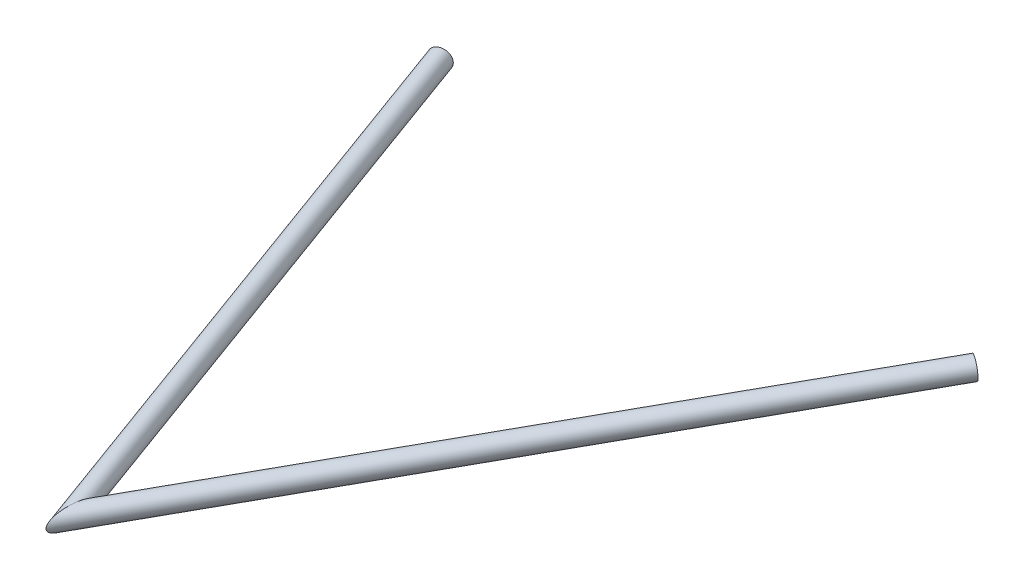
ISO-10303-21;
HEADER;
FILE_DESCRIPTION(('STEP AP214'),'2;1');
FILE_NAME('part.step','',(''),(''),'','','');
FILE_SCHEMA(('AUTOMOTIVE_DESIGN { 1 0 10303 214 1 1 1 1 }'));
ENDSEC;
DATA;
#1=APPLICATION_CONTEXT('core data for automotive mechanical design processes');
#2=APPLICATION_PROTOCOL_DEFINITION('international standard','automotive_design',2000,#1);
#3=PRODUCT_CONTEXT('',#1,'mechanical');
#4=PRODUCT('Part','Part','',(#3));
#5=PRODUCT_RELATED_PRODUCT_CATEGORY('part','',(#4));
#6=PRODUCT_DEFINITION_FORMATION('','',#4);
#7=PRODUCT_DEFINITION_CONTEXT('part definition',#1,'design');
#8=PRODUCT_DEFINITION('design','',#6,#7);
#9=PRODUCT_DEFINITION_SHAPE('','',#8);
#10=(LENGTH_UNIT() NAMED_UNIT(*) SI_UNIT(.MILLI.,.METRE.));
#11=(NAMED_UNIT(*) PLANE_ANGLE_UNIT() SI_UNIT($,.RADIAN.));
#12=(NAMED_UNIT(*) SI_UNIT($,.STERADIAN.) SOLID_ANGLE_UNIT());
#13=UNCERTAINTY_MEASURE_WITH_UNIT(LENGTH_MEASURE(1.E-05),#10,'distance_accuracy_value','');
#14=(GEOMETRIC_REPRESENTATION_CONTEXT(3) GLOBAL_UNCERTAINTY_ASSIGNED_CONTEXT((#13)) GLOBAL_UNIT_ASSIGNED_CONTEXT((#10,
#11,#12)) REPRESENTATION_CONTEXT('',''));
#15=CARTESIAN_POINT('',(0.,0.,0.));
#16=DIRECTION('',(0.,0.,1.));
#17=DIRECTION('',(1.,0.,0.));
#18=AXIS2_PLACEMENT_3D('',#15,#16,#17);
#19=CARTESIAN_POINT('',(-16.5777935943057,-30.7428869106098,-28.3748648925404));
#20=DIRECTION('',(0.544828118843714,0.0504291441679957,-0.837030000857618));
#21=DIRECTION('',(-0.838096360085613,0.,-0.545522218806206));
#22=AXIS2_PLACEMENT_3D('',#19,#20,#21);
#23=CYLINDRICAL_SURFACE('',#22,6.985);
#24=CARTESIAN_POINT('',(315.563263321795,0.,-538.649609421802));
#25=DIRECTION('',(-0.544828118843714,-0.0504291441679957,0.837030000857618));
#26=DIRECTION('',(0.838401311118088,-0.0141057549224391,0.544870873871543));
#27=AXIS2_PLACEMENT_3D('',#24,#25,#26);
#28=CIRCLE('',#27,6.985);
#29=CARTESIAN_POINT('',(321.419496479955,-0.0985286981332999,-534.843686367809));
#30=VERTEX_POINT('',#29);
#31=EDGE_CURVE('E62',#30,#30,#28,.T.);
#32=ORIENTED_EDGE('',*,*,#31,.F.);
#33=EDGE_LOOP('',(#32));
#34=FACE_BOUND('',#33,.T.);
#35=CARTESIAN_POINT('',(-16.5777935943057,-30.7428869106098,-28.3748648925404));
#36=DIRECTION('',(-0.991513492407896,0.00781825679418406,-0.129768521736961));
#37=DIRECTION('',(0.130003824455652,0.0596283004057895,-0.989718885046467));
#38=AXIS2_PLACEMENT_3D('',#35,#36,#37);
#39=ELLIPSE('',#38,16.1993546333084,6.985);
#40=CARTESIAN_POINT('',(-14.4718155382622,-29.7769469261549,-44.4076720986907));
#41=VERTEX_POINT('',#40);
#42=EDGE_CURVE('E58',#41,#41,#39,.T.);
#43=ORIENTED_EDGE('',*,*,#42,.T.);
#44=EDGE_LOOP('',(#43));
#45=FACE_BOUND('',#44,.T.);
#46=ADVANCED_FACE('F54',(#34,#45),#23,.F.);
#47=CARTESIAN_POINT('',(-16.5777935943057,-30.7428869106098,-28.3748648925404));
#48=DIRECTION('',(0.544828118843714,0.0504291441679957,-0.837030000857618));
#49=DIRECTION('',(-0.838096360085613,0.,-0.545522218806206));
#50=AXIS2_PLACEMENT_3D('',#47,#48,#49);
#51=CYLINDRICAL_SURFACE('',#50,9.525);
#52=CARTESIAN_POINT('',(315.563263321795,0.,-538.649609421802));
#53=DIRECTION('',(-0.544828118843714,-0.0504291441679957,0.837030000857618));
#54=DIRECTION('',(0.838401311118088,-0.0141057549224391,0.544870873871543));
#55=AXIS2_PLACEMENT_3D('',#52,#53,#54);
#56=CIRCLE('',#55,9.525);
#57=CARTESIAN_POINT('',(323.549035810195,-0.134357315636295,-533.459714348175));
#58=VERTEX_POINT('',#57);
#59=EDGE_CURVE('E66',#58,#58,#56,.T.);
#60=ORIENTED_EDGE('',*,*,#59,.T.);
#61=EDGE_LOOP('',(#60));
#62=FACE_BOUND('',#61,.T.);
#63=CARTESIAN_POINT('',(-16.5777935943057,-30.7428869106098,-28.3748648925404));
#64=DIRECTION('',(-0.991513492407896,0.00781825679418406,-0.129768521736961));
#65=DIRECTION('',(0.130003824455652,0.0596283004057895,-0.989718885046467));
#66=AXIS2_PLACEMENT_3D('',#63,#64,#65);
#67=ELLIPSE('',#66,22.0900290454206,9.525);
#68=CARTESIAN_POINT('',(-13.7060053360646,-29.4256960227168,-50.2377838100181));
#69=VERTEX_POINT('',#68);
#70=EDGE_CURVE('E12',#69,#69,#67,.T.);
#71=ORIENTED_EDGE('',*,*,#70,.F.);
#72=EDGE_LOOP('',(#71));
#73=FACE_BOUND('',#72,.T.);
#74=ADVANCED_FACE('F81',(#62,#73),#51,.T.);
#75=CARTESIAN_POINT('',(315.563263321795,0.,-538.649609421802));
#76=DIRECTION('',(-0.544828118843714,-0.0504291441679957,0.837030000857618));
#77=DIRECTION('',(0.838401311118088,-0.0141057549224391,0.544870873871543));
#78=AXIS2_PLACEMENT_3D('',#75,#76,#77);
#79=PLANE('',#78);
#80=ORIENTED_EDGE('',*,*,#31,.T.);
#81=EDGE_LOOP('',(#80));
#82=FACE_BOUND('',#81,.T.);
#83=ORIENTED_EDGE('',*,*,#59,.F.);
#84=EDGE_LOOP('',(#83));
#85=FACE_BOUND('',#84,.T.);
#86=ADVANCED_FACE('F77',(#82,#85),#79,.F.);
#87=CARTESIAN_POINT('',(-16.5777935943057,-30.7428869106098,-28.3748648925403));
#88=DIRECTION('',(-0.991513492407896,0.00781825679418406,-0.129768521736961));
#89=DIRECTION('',(-0.129772487978274,0.,0.991543796997353));
#90=AXIS2_PLACEMENT_3D('',#87,#88,#89);
#91=PLANE('',#90);
#92=ORIENTED_EDGE('',*,*,#42,.F.);
#93=EDGE_LOOP('',(#92));
#94=FACE_BOUND('',#93,.T.);
#95=ORIENTED_EDGE('',*,*,#70,.T.);
#96=EDGE_LOOP('',(#95));
#97=FACE_BOUND('',#96,.T.);
#98=ADVANCED_FACE('F56',(#94,#97),#91,.T.);
#99=CLOSED_SHELL('',(#46,#74,#86,#98));
#100=MANIFOLD_SOLID_BREP('B2',#99);
#101=CARTESIAN_POINT('',(-183.4,0.,-538.649609421802));
#102=DIRECTION('',(0.310233320484096,-0.05717145272825,0.948939783049669));
#103=DIRECTION('',(0.950494435642445,0.,-0.310741577219319));
#104=AXIS2_PLACEMENT_3D('',#101,#102,#103);
#105=CYLINDRICAL_SURFACE('',#104,6.985);
#106=CARTESIAN_POINT('',(-183.4,0.,-538.649609421802));
#107=DIRECTION('',(-0.310233320484096,0.05717145272825,-0.948939783049669));
#108=DIRECTION('',(-0.950494435642445,0.,0.310741577219319));
#109=AXIS2_PLACEMENT_3D('',#106,#107,#108);
#110=CIRCLE('',#109,6.985);
#111=CARTESIAN_POINT('',(-190.039203632962,0.,-536.479079504925));
#112=VERTEX_POINT('',#111);
#113=EDGE_CURVE('E158',#112,#112,#110,.T.);
#114=ORIENTED_EDGE('',*,*,#113,.T.);
#115=EDGE_LOOP('',(#114));
#116=FACE_BOUND('',#115,.T.);
#117=CARTESIAN_POINT('',(-16.5777935943057,-30.7428869106097,-28.3748648925404));
#118=DIRECTION('',(0.991513492407896,-0.00781825679418406,0.129768521736961));
#119=DIRECTION('',(-0.130003824455652,-0.0596283004057895,0.989718885046467));
#120=AXIS2_PLACEMENT_3D('',#117,#118,#119);
#121=ELLIPSE('',#120,16.1993546333084,6.985);
#122=CARTESIAN_POINT('',(-18.6837716503492,-31.7088268950646,-12.3420576863901));
#123=VERTEX_POINT('',#122);
#124=EDGE_CURVE('E148',#123,#123,#121,.T.);
#125=ORIENTED_EDGE('',*,*,#124,.T.);
#126=EDGE_LOOP('',(#125));
#127=FACE_BOUND('',#126,.T.);
#128=ADVANCED_FACE('F144',(#116,#127),#105,.F.);
#129=CARTESIAN_POINT('',(-183.4,0.,-538.649609421802));
#130=DIRECTION('',(0.310233320484096,-0.05717145272825,0.948939783049669));
#131=DIRECTION('',(0.950494435642445,0.,-0.310741577219319));
#132=AXIS2_PLACEMENT_3D('',#129,#130,#131);
#133=CYLINDRICAL_SURFACE('',#132,9.525);
#134=CARTESIAN_POINT('',(-183.4,0.,-538.649609421802));
#135=DIRECTION('',(-0.310233320484096,0.05717145272825,-0.948939783049669));
#136=DIRECTION('',(-0.950494435642445,0.,0.310741577219319));
#137=AXIS2_PLACEMENT_3D('',#134,#135,#136);
#138=CIRCLE('',#137,9.525);
#139=CARTESIAN_POINT('',(-192.453459499494,0.,-535.689795898788));
#140=VERTEX_POINT('',#139);
#141=EDGE_CURVE('E152',#140,#140,#138,.T.);
#142=ORIENTED_EDGE('',*,*,#141,.F.);
#143=EDGE_LOOP('',(#142));
#144=FACE_BOUND('',#143,.T.);
#145=CARTESIAN_POINT('',(-16.5777935943057,-30.7428869106097,-28.3748648925404));
#146=DIRECTION('',(0.991513492407896,-0.00781825679418406,0.129768521736961));
#147=DIRECTION('',(-0.130003824455652,-0.0596283004057895,0.989718885046467));
#148=AXIS2_PLACEMENT_3D('',#145,#146,#147);
#149=ELLIPSE('',#148,22.0900290454206,9.525);
#150=CARTESIAN_POINT('',(-19.4495818525469,-32.0600777985027,-6.51194597506266));
#151=VERTEX_POINT('',#150);
#152=EDGE_CURVE('E53',#151,#151,#149,.T.);
#153=ORIENTED_EDGE('',*,*,#152,.F.);
#154=EDGE_LOOP('',(#153));
#155=FACE_BOUND('',#154,.T.);
#156=ADVANCED_FACE('F171',(#144,#155),#133,.T.);
#157=CARTESIAN_POINT('',(-183.4,0.,-538.649609421802));
#158=DIRECTION('',(-0.310233320484096,0.05717145272825,-0.948939783049669));
#159=DIRECTION('',(-0.950494435642445,0.,0.310741577219319));
#160=AXIS2_PLACEMENT_3D('',#157,#158,#159);
#161=PLANE('',#160);
#162=ORIENTED_EDGE('',*,*,#113,.F.);
#163=EDGE_LOOP('',(#162));
#164=FACE_BOUND('',#163,.T.);
#165=ORIENTED_EDGE('',*,*,#141,.T.);
#166=EDGE_LOOP('',(#165));
#167=FACE_BOUND('',#166,.T.);
#168=ADVANCED_FACE('F167',(#164,#167),#161,.T.);
#169=CARTESIAN_POINT('',(-16.5777935943057,-30.7428869106098,-28.3748648925403));
#170=DIRECTION('',(0.991513492407896,-0.00781825679418406,0.129768521736961));
#171=DIRECTION('',(0.129772487978274,0.,-0.991543796997353));
#172=AXIS2_PLACEMENT_3D('',#169,#170,#171);
#173=PLANE('',#172);
#174=ORIENTED_EDGE('',*,*,#124,.F.);
#175=EDGE_LOOP('',(#174));
#176=FACE_BOUND('',#175,.T.);
#177=ORIENTED_EDGE('',*,*,#152,.T.);
#178=EDGE_LOOP('',(#177));
#179=FACE_BOUND('',#178,.T.);
#180=ADVANCED_FACE('F146',(#176,#179),#173,.T.);
#181=CLOSED_SHELL('',(#128,#156,#168,#180));
#182=MANIFOLD_SOLID_BREP('B7',#181);
#183=ADVANCED_BREP_SHAPE_REPRESENTATION('',(#18,#100,#182),#14);
#184=SHAPE_DEFINITION_REPRESENTATION(#9,#183);
ENDSEC;
END-ISO-10303-21;
